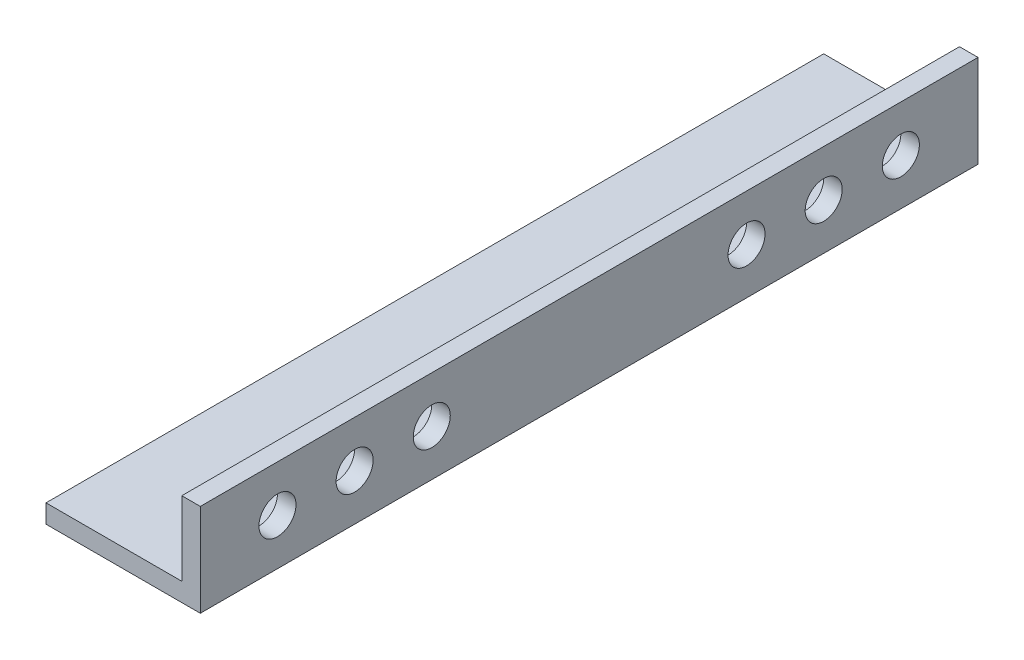
ISO-10303-21;
HEADER;
FILE_DESCRIPTION(('STEP AP214'),'2;1');
FILE_NAME('part.step','',(''),(''),'','','');
FILE_SCHEMA(('AUTOMOTIVE_DESIGN { 1 0 10303 214 1 1 1 1 }'));
ENDSEC;
DATA;
#1=APPLICATION_CONTEXT('core data for automotive mechanical design processes');
#2=APPLICATION_PROTOCOL_DEFINITION('international standard','automotive_design',2000,#1);
#3=PRODUCT_CONTEXT('',#1,'mechanical');
#4=PRODUCT('Part','Part','',(#3));
#5=PRODUCT_RELATED_PRODUCT_CATEGORY('part','',(#4));
#6=PRODUCT_DEFINITION_FORMATION('','',#4);
#7=PRODUCT_DEFINITION_CONTEXT('part definition',#1,'design');
#8=PRODUCT_DEFINITION('design','',#6,#7);
#9=PRODUCT_DEFINITION_SHAPE('','',#8);
#10=(LENGTH_UNIT() NAMED_UNIT(*) SI_UNIT(.MILLI.,.METRE.));
#11=(NAMED_UNIT(*) PLANE_ANGLE_UNIT() SI_UNIT($,.RADIAN.));
#12=(NAMED_UNIT(*) SI_UNIT($,.STERADIAN.) SOLID_ANGLE_UNIT());
#13=UNCERTAINTY_MEASURE_WITH_UNIT(LENGTH_MEASURE(1.E-05),#10,'distance_accuracy_value','');
#14=(GEOMETRIC_REPRESENTATION_CONTEXT(3) GLOBAL_UNCERTAINTY_ASSIGNED_CONTEXT((#13)) GLOBAL_UNIT_ASSIGNED_CONTEXT((#10,
#11,#12)) REPRESENTATION_CONTEXT('',''));
#15=CARTESIAN_POINT('',(0.,0.,0.));
#16=DIRECTION('',(0.,0.,1.));
#17=DIRECTION('',(1.,0.,0.));
#18=AXIS2_PLACEMENT_3D('',#15,#16,#17);
#19=CARTESIAN_POINT('',(0.,-12.,126.));
#20=DIRECTION('',(1.,0.,0.));
#21=DIRECTION('',(0.,0.,-1.));
#22=AXIS2_PLACEMENT_3D('',#19,#20,#21);
#23=PLANE('',#22);
#24=CARTESIAN_POINT('',(0.,-7.5,113.5));
#25=DIRECTION('',(1.,0.,0.));
#26=DIRECTION('',(0.,0.,-1.));
#27=AXIS2_PLACEMENT_3D('',#24,#25,#26);
#28=CIRCLE('',#27,3.00000000000001);
#29=CARTESIAN_POINT('',(0.,-7.5,110.5));
#30=VERTEX_POINT('',#29);
#31=EDGE_CURVE('E135',#30,#30,#28,.T.);
#32=ORIENTED_EDGE('',*,*,#31,.T.);
#33=EDGE_LOOP('',(#32));
#34=FACE_BOUND('',#33,.T.);
#35=CARTESIAN_POINT('',(0.,-7.5,37.5));
#36=DIRECTION('',(1.,0.,0.));
#37=DIRECTION('',(0.,0.,-1.));
#38=AXIS2_PLACEMENT_3D('',#35,#36,#37);
#39=CIRCLE('',#38,3.00000000000001);
#40=CARTESIAN_POINT('',(0.,-7.5,34.5));
#41=VERTEX_POINT('',#40);
#42=EDGE_CURVE('E179',#41,#41,#39,.T.);
#43=ORIENTED_EDGE('',*,*,#42,.T.);
#44=EDGE_LOOP('',(#43));
#45=FACE_BOUND('',#44,.T.);
#46=CARTESIAN_POINT('',(0.,-7.5,25.));
#47=DIRECTION('',(1.,0.,0.));
#48=DIRECTION('',(0.,0.,-1.));
#49=AXIS2_PLACEMENT_3D('',#46,#47,#48);
#50=CIRCLE('',#49,3.00000000000001);
#51=CARTESIAN_POINT('',(0.,-7.5,22.));
#52=VERTEX_POINT('',#51);
#53=EDGE_CURVE('E175',#52,#52,#50,.T.);
#54=ORIENTED_EDGE('',*,*,#53,.T.);
#55=EDGE_LOOP('',(#54));
#56=FACE_BOUND('',#55,.T.);
#57=CARTESIAN_POINT('',(0.,-7.5,12.5));
#58=DIRECTION('',(1.,0.,0.));
#59=DIRECTION('',(0.,0.,-1.));
#60=AXIS2_PLACEMENT_3D('',#57,#58,#59);
#61=CIRCLE('',#60,3.00000000000001);
#62=CARTESIAN_POINT('',(0.,-7.5,9.49999999999999));
#63=VERTEX_POINT('',#62);
#64=EDGE_CURVE('E171',#63,#63,#61,.T.);
#65=ORIENTED_EDGE('',*,*,#64,.T.);
#66=EDGE_LOOP('',(#65));
#67=FACE_BOUND('',#66,.T.);
#68=CARTESIAN_POINT('',(0.,-7.5,88.5));
#69=DIRECTION('',(1.,0.,0.));
#70=DIRECTION('',(0.,0.,-1.));
#71=AXIS2_PLACEMENT_3D('',#68,#69,#70);
#72=CIRCLE('',#71,3.00000000000001);
#73=CARTESIAN_POINT('',(0.,-7.5,85.5));
#74=VERTEX_POINT('',#73);
#75=EDGE_CURVE('E166',#74,#74,#72,.T.);
#76=ORIENTED_EDGE('',*,*,#75,.T.);
#77=EDGE_LOOP('',(#76));
#78=FACE_BOUND('',#77,.T.);
#79=CARTESIAN_POINT('',(0.,-7.5,101.));
#80=DIRECTION('',(1.,0.,0.));
#81=DIRECTION('',(0.,0.,-1.));
#82=AXIS2_PLACEMENT_3D('',#79,#80,#81);
#83=CIRCLE('',#82,3.00000000000001);
#84=CARTESIAN_POINT('',(0.,-7.5,98.));
#85=VERTEX_POINT('',#84);
#86=EDGE_CURVE('E161',#85,#85,#83,.T.);
#87=ORIENTED_EDGE('',*,*,#86,.T.);
#88=EDGE_LOOP('',(#87));
#89=FACE_BOUND('',#88,.T.);
#90=DIRECTION('',(0.,-1.,0.));
#91=VECTOR('',#90,1.);
#92=CARTESIAN_POINT('',(0.,-12.,0.));
#93=LINE('',#92,#91);
#94=CARTESIAN_POINT('',(0.,0.,0.));
#95=VERTEX_POINT('',#94);
#96=CARTESIAN_POINT('',(0.,-12.,0.));
#97=VERTEX_POINT('',#96);
#98=EDGE_CURVE('E130',#95,#97,#93,.T.);
#99=ORIENTED_EDGE('',*,*,#98,.T.);
#100=DIRECTION('',(0.,0.,-1.));
#101=VECTOR('',#100,1.);
#102=CARTESIAN_POINT('',(0.,-12.,126.));
#103=LINE('',#102,#101);
#104=CARTESIAN_POINT('',(0.,-12.,126.));
#105=VERTEX_POINT('',#104);
#106=EDGE_CURVE('E11',#105,#97,#103,.T.);
#107=ORIENTED_EDGE('',*,*,#106,.F.);
#108=DIRECTION('',(0.,-1.,0.));
#109=VECTOR('',#108,1.);
#110=CARTESIAN_POINT('',(0.,-12.,126.));
#111=LINE('',#110,#109);
#112=CARTESIAN_POINT('',(0.,0.,126.));
#113=VERTEX_POINT('',#112);
#114=EDGE_CURVE('E147',#113,#105,#111,.T.);
#115=ORIENTED_EDGE('',*,*,#114,.F.);
#116=DIRECTION('',(0.,0.,-1.));
#117=VECTOR('',#116,1.);
#118=CARTESIAN_POINT('',(0.,0.,126.));
#119=LINE('',#118,#117);
#120=EDGE_CURVE('E126',#113,#95,#119,.T.);
#121=ORIENTED_EDGE('',*,*,#120,.T.);
#122=EDGE_LOOP('',(#99,#107,#115,#121));
#123=FACE_BOUND('',#122,.T.);
#124=ADVANCED_FACE('F39',(#34,#45,#56,#67,#78,#89,#123),#23,.F.);
#125=CARTESIAN_POINT('',(-22.,-12.,126.));
#126=DIRECTION('',(0.,-1.,0.));
#127=DIRECTION('',(1.,0.,0.));
#128=AXIS2_PLACEMENT_3D('',#125,#126,#127);
#129=PLANE('',#128);
#130=DIRECTION('',(-1.,0.,0.));
#131=VECTOR('',#130,1.);
#132=CARTESIAN_POINT('',(-22.,-12.,0.));
#133=LINE('',#132,#131);
#134=CARTESIAN_POINT('',(-22.,-12.,0.));
#135=VERTEX_POINT('',#134);
#136=EDGE_CURVE('E134',#97,#135,#133,.T.);
#137=ORIENTED_EDGE('',*,*,#136,.T.);
#138=DIRECTION('',(0.,0.,-1.));
#139=VECTOR('',#138,1.);
#140=CARTESIAN_POINT('',(-22.,-12.,126.));
#141=LINE('',#140,#139);
#142=CARTESIAN_POINT('',(-22.,-12.,126.));
#143=VERTEX_POINT('',#142);
#144=EDGE_CURVE('E49',#143,#135,#141,.T.);
#145=ORIENTED_EDGE('',*,*,#144,.F.);
#146=DIRECTION('',(-1.,0.,0.));
#147=VECTOR('',#146,1.);
#148=CARTESIAN_POINT('',(-22.,-12.,126.));
#149=LINE('',#148,#147);
#150=EDGE_CURVE('E95',#105,#143,#149,.T.);
#151=ORIENTED_EDGE('',*,*,#150,.F.);
#152=ORIENTED_EDGE('',*,*,#106,.T.);
#153=EDGE_LOOP('',(#137,#145,#151,#152));
#154=FACE_BOUND('',#153,.T.);
#155=ADVANCED_FACE('F214',(#154),#129,.F.);
#156=CARTESIAN_POINT('',(-22.,-15.,126.));
#157=DIRECTION('',(1.,0.,0.));
#158=DIRECTION('',(0.,0.,-1.));
#159=AXIS2_PLACEMENT_3D('',#156,#157,#158);
#160=PLANE('',#159);
#161=DIRECTION('',(0.,-1.,0.));
#162=VECTOR('',#161,1.);
#163=CARTESIAN_POINT('',(-22.,-15.,0.));
#164=LINE('',#163,#162);
#165=CARTESIAN_POINT('',(-22.,-15.,0.));
#166=VERTEX_POINT('',#165);
#167=EDGE_CURVE('E138',#135,#166,#164,.T.);
#168=ORIENTED_EDGE('',*,*,#167,.T.);
#169=DIRECTION('',(0.,0.,-1.));
#170=VECTOR('',#169,1.);
#171=CARTESIAN_POINT('',(-22.,-15.,126.));
#172=LINE('',#171,#170);
#173=CARTESIAN_POINT('',(-22.,-15.,126.));
#174=VERTEX_POINT('',#173);
#175=EDGE_CURVE('E119',#174,#166,#172,.T.);
#176=ORIENTED_EDGE('',*,*,#175,.F.);
#177=DIRECTION('',(0.,-1.,0.));
#178=VECTOR('',#177,1.);
#179=CARTESIAN_POINT('',(-22.,-15.,126.));
#180=LINE('',#179,#178);
#181=EDGE_CURVE('E108',#143,#174,#180,.T.);
#182=ORIENTED_EDGE('',*,*,#181,.F.);
#183=ORIENTED_EDGE('',*,*,#144,.T.);
#184=EDGE_LOOP('',(#168,#176,#182,#183));
#185=FACE_BOUND('',#184,.T.);
#186=ADVANCED_FACE('F233',(#185),#160,.F.);
#187=CARTESIAN_POINT('',(3.,-15.,126.));
#188=DIRECTION('',(0.,1.,0.));
#189=DIRECTION('',(-1.,0.,0.));
#190=AXIS2_PLACEMENT_3D('',#187,#188,#189);
#191=PLANE('',#190);
#192=DIRECTION('',(1.,0.,0.));
#193=VECTOR('',#192,1.);
#194=CARTESIAN_POINT('',(3.,-15.,0.));
#195=LINE('',#194,#193);
#196=CARTESIAN_POINT('',(3.,-15.,0.));
#197=VERTEX_POINT('',#196);
#198=EDGE_CURVE('E117',#166,#197,#195,.T.);
#199=ORIENTED_EDGE('',*,*,#198,.T.);
#200=DIRECTION('',(0.,0.,-1.));
#201=VECTOR('',#200,1.);
#202=CARTESIAN_POINT('',(3.,-15.,126.));
#203=LINE('',#202,#201);
#204=CARTESIAN_POINT('',(3.,-15.,126.));
#205=VERTEX_POINT('',#204);
#206=EDGE_CURVE('E114',#205,#197,#203,.T.);
#207=ORIENTED_EDGE('',*,*,#206,.F.);
#208=DIRECTION('',(1.,0.,0.));
#209=VECTOR('',#208,1.);
#210=CARTESIAN_POINT('',(3.,-15.,126.));
#211=LINE('',#210,#209);
#212=EDGE_CURVE('E102',#174,#205,#211,.T.);
#213=ORIENTED_EDGE('',*,*,#212,.F.);
#214=ORIENTED_EDGE('',*,*,#175,.T.);
#215=EDGE_LOOP('',(#199,#207,#213,#214));
#216=FACE_BOUND('',#215,.T.);
#217=ADVANCED_FACE('F115',(#216),#191,.F.);
#218=CARTESIAN_POINT('',(3.,0.,126.));
#219=DIRECTION('',(-1.,0.,0.));
#220=DIRECTION('',(0.,-1.,0.));
#221=AXIS2_PLACEMENT_3D('',#218,#219,#220);
#222=PLANE('',#221);
#223=CARTESIAN_POINT('',(3.,-7.5,113.5));
#224=DIRECTION('',(-1.,0.,0.));
#225=DIRECTION('',(0.,-1.,0.));
#226=AXIS2_PLACEMENT_3D('',#223,#224,#225);
#227=CIRCLE('',#226,3.00000000000001);
#228=CARTESIAN_POINT('',(3.,-10.5,113.5));
#229=VERTEX_POINT('',#228);
#230=EDGE_CURVE('E42',#229,#229,#227,.T.);
#231=ORIENTED_EDGE('',*,*,#230,.T.);
#232=EDGE_LOOP('',(#231));
#233=FACE_BOUND('',#232,.T.);
#234=CARTESIAN_POINT('',(3.,-7.5,37.5));
#235=DIRECTION('',(-1.,0.,0.));
#236=DIRECTION('',(0.,-1.,0.));
#237=AXIS2_PLACEMENT_3D('',#234,#235,#236);
#238=CIRCLE('',#237,3.00000000000001);
#239=CARTESIAN_POINT('',(3.,-10.5,37.5));
#240=VERTEX_POINT('',#239);
#241=EDGE_CURVE('E176',#240,#240,#238,.T.);
#242=ORIENTED_EDGE('',*,*,#241,.T.);
#243=EDGE_LOOP('',(#242));
#244=FACE_BOUND('',#243,.T.);
#245=CARTESIAN_POINT('',(3.,-7.5,25.));
#246=DIRECTION('',(-1.,0.,0.));
#247=DIRECTION('',(0.,-1.,0.));
#248=AXIS2_PLACEMENT_3D('',#245,#246,#247);
#249=CIRCLE('',#248,3.00000000000001);
#250=CARTESIAN_POINT('',(3.,-10.5,25.));
#251=VERTEX_POINT('',#250);
#252=EDGE_CURVE('E172',#251,#251,#249,.T.);
#253=ORIENTED_EDGE('',*,*,#252,.T.);
#254=EDGE_LOOP('',(#253));
#255=FACE_BOUND('',#254,.T.);
#256=CARTESIAN_POINT('',(3.,-7.5,12.5));
#257=DIRECTION('',(-1.,0.,0.));
#258=DIRECTION('',(0.,-1.,0.));
#259=AXIS2_PLACEMENT_3D('',#256,#257,#258);
#260=CIRCLE('',#259,3.00000000000001);
#261=CARTESIAN_POINT('',(3.,-10.5,12.5));
#262=VERTEX_POINT('',#261);
#263=EDGE_CURVE('E167',#262,#262,#260,.T.);
#264=ORIENTED_EDGE('',*,*,#263,.T.);
#265=EDGE_LOOP('',(#264));
#266=FACE_BOUND('',#265,.T.);
#267=CARTESIAN_POINT('',(3.,-7.5,88.5));
#268=DIRECTION('',(-1.,0.,0.));
#269=DIRECTION('',(0.,-1.,0.));
#270=AXIS2_PLACEMENT_3D('',#267,#268,#269);
#271=CIRCLE('',#270,3.00000000000001);
#272=CARTESIAN_POINT('',(3.,-10.5,88.5));
#273=VERTEX_POINT('',#272);
#274=EDGE_CURVE('E162',#273,#273,#271,.T.);
#275=ORIENTED_EDGE('',*,*,#274,.T.);
#276=EDGE_LOOP('',(#275));
#277=FACE_BOUND('',#276,.T.);
#278=CARTESIAN_POINT('',(3.,-7.5,101.));
#279=DIRECTION('',(-1.,0.,0.));
#280=DIRECTION('',(0.,-1.,0.));
#281=AXIS2_PLACEMENT_3D('',#278,#279,#280);
#282=CIRCLE('',#281,3.00000000000001);
#283=CARTESIAN_POINT('',(3.,-10.5,101.));
#284=VERTEX_POINT('',#283);
#285=EDGE_CURVE('E157',#284,#284,#282,.T.);
#286=ORIENTED_EDGE('',*,*,#285,.T.);
#287=EDGE_LOOP('',(#286));
#288=FACE_BOUND('',#287,.T.);
#289=DIRECTION('',(0.,1.,0.));
#290=VECTOR('',#289,1.);
#291=CARTESIAN_POINT('',(3.,0.,0.));
#292=LINE('',#291,#290);
#293=CARTESIAN_POINT('',(3.,0.,0.));
#294=VERTEX_POINT('',#293);
#295=EDGE_CURVE('E81',#197,#294,#292,.T.);
#296=ORIENTED_EDGE('',*,*,#295,.T.);
#297=DIRECTION('',(0.,0.,-1.));
#298=VECTOR('',#297,1.);
#299=CARTESIAN_POINT('',(3.,0.,126.));
#300=LINE('',#299,#298);
#301=CARTESIAN_POINT('',(3.,0.,126.));
#302=VERTEX_POINT('',#301);
#303=EDGE_CURVE('E120',#302,#294,#300,.T.);
#304=ORIENTED_EDGE('',*,*,#303,.F.);
#305=DIRECTION('',(0.,1.,0.));
#306=VECTOR('',#305,1.);
#307=CARTESIAN_POINT('',(3.,0.,126.));
#308=LINE('',#307,#306);
#309=EDGE_CURVE('E106',#205,#302,#308,.T.);
#310=ORIENTED_EDGE('',*,*,#309,.F.);
#311=ORIENTED_EDGE('',*,*,#206,.T.);
#312=EDGE_LOOP('',(#296,#304,#310,#311));
#313=FACE_BOUND('',#312,.T.);
#314=ADVANCED_FACE('F122',(#233,#244,#255,#266,#277,#288,#313),#222,.F.);
#315=CARTESIAN_POINT('',(0.,0.,126.));
#316=DIRECTION('',(0.,-1.,0.));
#317=DIRECTION('',(0.,0.,-1.));
#318=AXIS2_PLACEMENT_3D('',#315,#316,#317);
#319=PLANE('',#318);
#320=DIRECTION('',(-1.,0.,0.));
#321=VECTOR('',#320,1.);
#322=CARTESIAN_POINT('',(0.,0.,0.));
#323=LINE('',#322,#321);
#324=EDGE_CURVE('E87',#294,#95,#323,.T.);
#325=ORIENTED_EDGE('',*,*,#324,.T.);
#326=ORIENTED_EDGE('',*,*,#120,.F.);
#327=DIRECTION('',(-1.,0.,0.));
#328=VECTOR('',#327,1.);
#329=CARTESIAN_POINT('',(0.,0.,126.));
#330=LINE('',#329,#328);
#331=EDGE_CURVE('E58',#302,#113,#330,.T.);
#332=ORIENTED_EDGE('',*,*,#331,.F.);
#333=ORIENTED_EDGE('',*,*,#303,.T.);
#334=EDGE_LOOP('',(#325,#326,#332,#333));
#335=FACE_BOUND('',#334,.T.);
#336=ADVANCED_FACE('F244',(#335),#319,.F.);
#337=CARTESIAN_POINT('',(0.,0.,126.));
#338=DIRECTION('',(0.,0.,-1.));
#339=DIRECTION('',(-1.,0.,0.));
#340=AXIS2_PLACEMENT_3D('',#337,#338,#339);
#341=PLANE('',#340);
#342=ORIENTED_EDGE('',*,*,#114,.T.);
#343=ORIENTED_EDGE('',*,*,#150,.T.);
#344=ORIENTED_EDGE('',*,*,#181,.T.);
#345=ORIENTED_EDGE('',*,*,#212,.T.);
#346=ORIENTED_EDGE('',*,*,#309,.T.);
#347=ORIENTED_EDGE('',*,*,#331,.T.);
#348=EDGE_LOOP('',(#342,#343,#344,#345,#346,#347));
#349=FACE_BOUND('',#348,.T.);
#350=ADVANCED_FACE('F104',(#349),#341,.F.);
#351=CARTESIAN_POINT('',(0.,0.,0.));
#352=DIRECTION('',(0.,0.,-1.));
#353=DIRECTION('',(-1.,0.,0.));
#354=AXIS2_PLACEMENT_3D('',#351,#352,#353);
#355=PLANE('',#354);
#356=ORIENTED_EDGE('',*,*,#98,.F.);
#357=ORIENTED_EDGE('',*,*,#324,.F.);
#358=ORIENTED_EDGE('',*,*,#295,.F.);
#359=ORIENTED_EDGE('',*,*,#198,.F.);
#360=ORIENTED_EDGE('',*,*,#167,.F.);
#361=ORIENTED_EDGE('',*,*,#136,.F.);
#362=EDGE_LOOP('',(#356,#357,#358,#359,#360,#361));
#363=FACE_BOUND('',#362,.T.);
#364=ADVANCED_FACE('F230',(#363),#355,.T.);
#365=CARTESIAN_POINT('',(-60.,-7.50000000000001,101.));
#366=DIRECTION('',(1.,0.,0.));
#367=DIRECTION('',(0.,1.,0.));
#368=AXIS2_PLACEMENT_3D('',#365,#366,#367);
#369=CYLINDRICAL_SURFACE('',#368,3.00000000000001);
#370=ORIENTED_EDGE('',*,*,#285,.F.);
#371=EDGE_LOOP('',(#370));
#372=FACE_BOUND('',#371,.T.);
#373=ORIENTED_EDGE('',*,*,#86,.F.);
#374=EDGE_LOOP('',(#373));
#375=FACE_BOUND('',#374,.T.);
#376=ADVANCED_FACE('F249',(#372,#375),#369,.F.);
#377=CARTESIAN_POINT('',(-60.,-7.50000000000001,88.5));
#378=DIRECTION('',(1.,0.,0.));
#379=DIRECTION('',(0.,1.,0.));
#380=AXIS2_PLACEMENT_3D('',#377,#378,#379);
#381=CYLINDRICAL_SURFACE('',#380,3.00000000000001);
#382=ORIENTED_EDGE('',*,*,#274,.F.);
#383=EDGE_LOOP('',(#382));
#384=FACE_BOUND('',#383,.T.);
#385=ORIENTED_EDGE('',*,*,#75,.F.);
#386=EDGE_LOOP('',(#385));
#387=FACE_BOUND('',#386,.T.);
#388=ADVANCED_FACE('F259',(#384,#387),#381,.F.);
#389=CARTESIAN_POINT('',(-60.,-7.50000000000001,12.5));
#390=DIRECTION('',(1.,0.,0.));
#391=DIRECTION('',(0.,1.,0.));
#392=AXIS2_PLACEMENT_3D('',#389,#390,#391);
#393=CYLINDRICAL_SURFACE('',#392,3.00000000000001);
#394=ORIENTED_EDGE('',*,*,#263,.F.);
#395=EDGE_LOOP('',(#394));
#396=FACE_BOUND('',#395,.T.);
#397=ORIENTED_EDGE('',*,*,#64,.F.);
#398=EDGE_LOOP('',(#397));
#399=FACE_BOUND('',#398,.T.);
#400=ADVANCED_FACE('F255',(#396,#399),#393,.F.);
#401=CARTESIAN_POINT('',(-60.,-7.50000000000001,25.));
#402=DIRECTION('',(1.,0.,0.));
#403=DIRECTION('',(0.,1.,0.));
#404=AXIS2_PLACEMENT_3D('',#401,#402,#403);
#405=CYLINDRICAL_SURFACE('',#404,3.00000000000001);
#406=ORIENTED_EDGE('',*,*,#252,.F.);
#407=EDGE_LOOP('',(#406));
#408=FACE_BOUND('',#407,.T.);
#409=ORIENTED_EDGE('',*,*,#53,.F.);
#410=EDGE_LOOP('',(#409));
#411=FACE_BOUND('',#410,.T.);
#412=ADVANCED_FACE('F252',(#408,#411),#405,.F.);
#413=CARTESIAN_POINT('',(-60.,-7.50000000000001,37.5));
#414=DIRECTION('',(1.,0.,0.));
#415=DIRECTION('',(0.,1.,0.));
#416=AXIS2_PLACEMENT_3D('',#413,#414,#415);
#417=CYLINDRICAL_SURFACE('',#416,3.00000000000001);
#418=ORIENTED_EDGE('',*,*,#241,.F.);
#419=EDGE_LOOP('',(#418));
#420=FACE_BOUND('',#419,.T.);
#421=ORIENTED_EDGE('',*,*,#42,.F.);
#422=EDGE_LOOP('',(#421));
#423=FACE_BOUND('',#422,.T.);
#424=ADVANCED_FACE('F208',(#420,#423),#417,.F.);
#425=CARTESIAN_POINT('',(-60.,-7.50000000000001,113.5));
#426=DIRECTION('',(1.,0.,0.));
#427=DIRECTION('',(0.,1.,0.));
#428=AXIS2_PLACEMENT_3D('',#425,#426,#427);
#429=CYLINDRICAL_SURFACE('',#428,3.00000000000001);
#430=ORIENTED_EDGE('',*,*,#230,.F.);
#431=EDGE_LOOP('',(#430));
#432=FACE_BOUND('',#431,.T.);
#433=ORIENTED_EDGE('',*,*,#31,.F.);
#434=EDGE_LOOP('',(#433));
#435=FACE_BOUND('',#434,.T.);
#436=ADVANCED_FACE('F205',(#432,#435),#429,.F.);
#437=CLOSED_SHELL('',(#124,#155,#186,#217,#314,#336,#350,#364,#376,#388,#400,#412,#424,#436));
#438=MANIFOLD_SOLID_BREP('B2',#437);
#439=ADVANCED_BREP_SHAPE_REPRESENTATION('',(#18,#438),#14);
#440=SHAPE_DEFINITION_REPRESENTATION(#9,#439);
ENDSEC;
END-ISO-10303-21;
